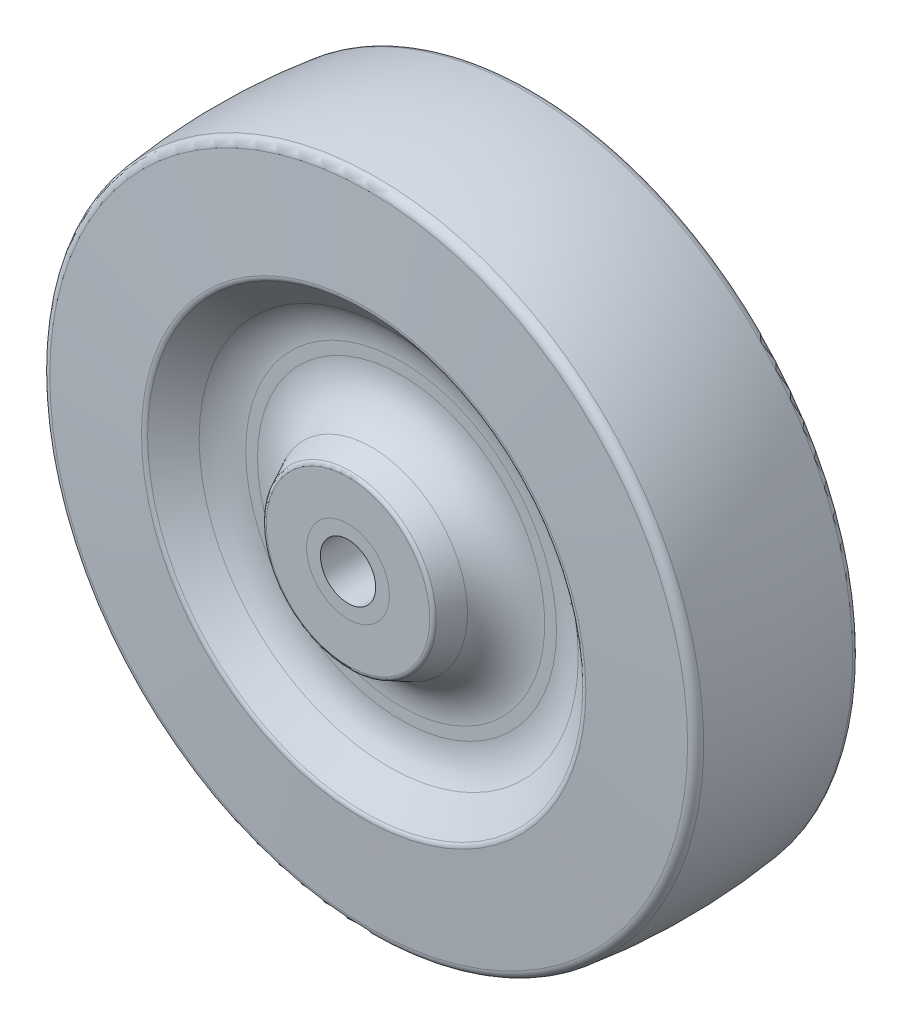
ISO-10303-21;
HEADER;
FILE_DESCRIPTION(('STEP AP214'),'2;1');
FILE_NAME('part.step','',(''),(''),'','','');
FILE_SCHEMA(('AUTOMOTIVE_DESIGN { 1 0 10303 214 1 1 1 1 }'));
ENDSEC;
DATA;
#1=APPLICATION_CONTEXT('core data for automotive mechanical design processes');
#2=APPLICATION_PROTOCOL_DEFINITION('international standard','automotive_design',2000,#1);
#3=PRODUCT_CONTEXT('',#1,'mechanical');
#4=PRODUCT('Part','Part','',(#3));
#5=PRODUCT_RELATED_PRODUCT_CATEGORY('part','',(#4));
#6=PRODUCT_DEFINITION_FORMATION('','',#4);
#7=PRODUCT_DEFINITION_CONTEXT('part definition',#1,'design');
#8=PRODUCT_DEFINITION('design','',#6,#7);
#9=PRODUCT_DEFINITION_SHAPE('','',#8);
#10=(LENGTH_UNIT() NAMED_UNIT(*) SI_UNIT(.MILLI.,.METRE.));
#11=(NAMED_UNIT(*) PLANE_ANGLE_UNIT() SI_UNIT($,.RADIAN.));
#12=(NAMED_UNIT(*) SI_UNIT($,.STERADIAN.) SOLID_ANGLE_UNIT());
#13=UNCERTAINTY_MEASURE_WITH_UNIT(LENGTH_MEASURE(1.E-05),#10,'distance_accuracy_value','');
#14=(GEOMETRIC_REPRESENTATION_CONTEXT(3) GLOBAL_UNCERTAINTY_ASSIGNED_CONTEXT((#13)) GLOBAL_UNIT_ASSIGNED_CONTEXT((#10,
#11,#12)) REPRESENTATION_CONTEXT('',''));
#15=CARTESIAN_POINT('',(0.,0.,0.));
#16=DIRECTION('',(0.,0.,1.));
#17=DIRECTION('',(1.,0.,0.));
#18=AXIS2_PLACEMENT_3D('',#15,#16,#17);
#19=CARTESIAN_POINT('',(0.,0.,11.8237));
#20=DIRECTION('',(0.,0.,-1.));
#21=DIRECTION('',(-1.,0.,0.));
#22=AXIS2_PLACEMENT_3D('',#19,#20,#21);
#23=PLANE('',#22);
#24=CARTESIAN_POINT('',(0.,0.,11.8237));
#25=DIRECTION('',(0.,0.,1.));
#26=DIRECTION('',(1.,0.,0.));
#27=AXIS2_PLACEMENT_3D('',#24,#25,#26);
#28=CIRCLE('',#27,3.175);
#29=CARTESIAN_POINT('',(3.175,0.,11.8237));
#30=VERTEX_POINT('',#29);
#31=EDGE_CURVE('E54',#30,#30,#28,.T.);
#32=ORIENTED_EDGE('',*,*,#31,.F.);
#33=EDGE_LOOP('',(#32));
#34=FACE_BOUND('',#33,.T.);
#35=CARTESIAN_POINT('',(0.,0.,11.8237));
#36=DIRECTION('',(0.,0.,1.));
#37=DIRECTION('',(1.,0.,0.));
#38=AXIS2_PLACEMENT_3D('',#35,#36,#37);
#39=CIRCLE('',#38,4.7498);
#40=CARTESIAN_POINT('',(4.7498,0.,11.8237));
#41=VERTEX_POINT('',#40);
#42=EDGE_CURVE('E46',#41,#41,#39,.T.);
#43=ORIENTED_EDGE('',*,*,#42,.T.);
#44=EDGE_LOOP('',(#43));
#45=FACE_BOUND('',#44,.T.);
#46=ADVANCED_FACE('F40',(#34,#45),#23,.F.);
#47=CARTESIAN_POINT('',(0.,0.,-11.8237));
#48=DIRECTION('',(0.,0.,1.));
#49=DIRECTION('',(1.,0.,0.));
#50=AXIS2_PLACEMENT_3D('',#47,#48,#49);
#51=PLANE('',#50);
#52=CARTESIAN_POINT('',(0.,0.,-11.8237));
#53=DIRECTION('',(0.,0.,1.));
#54=DIRECTION('',(1.,0.,0.));
#55=AXIS2_PLACEMENT_3D('',#52,#53,#54);
#56=CIRCLE('',#55,3.175);
#57=CARTESIAN_POINT('',(3.175,0.,-11.8237));
#58=VERTEX_POINT('',#57);
#59=EDGE_CURVE('E50',#58,#58,#56,.T.);
#60=ORIENTED_EDGE('',*,*,#59,.T.);
#61=EDGE_LOOP('',(#60));
#62=FACE_BOUND('',#61,.T.);
#63=CARTESIAN_POINT('',(0.,0.,-11.8237));
#64=DIRECTION('',(0.,0.,1.));
#65=DIRECTION('',(1.,0.,0.));
#66=AXIS2_PLACEMENT_3D('',#63,#64,#65);
#67=CIRCLE('',#66,4.7498);
#68=CARTESIAN_POINT('',(4.7498,0.,-11.8237));
#69=VERTEX_POINT('',#68);
#70=EDGE_CURVE('E11',#69,#69,#67,.T.);
#71=ORIENTED_EDGE('',*,*,#70,.F.);
#72=EDGE_LOOP('',(#71));
#73=FACE_BOUND('',#72,.T.);
#74=ADVANCED_FACE('F63',(#62,#73),#51,.F.);
#75=CARTESIAN_POINT('',(0.,0.,11.8237));
#76=DIRECTION('',(0.,0.,1.));
#77=DIRECTION('',(1.,0.,0.));
#78=AXIS2_PLACEMENT_3D('',#75,#76,#77);
#79=CYLINDRICAL_SURFACE('',#78,4.7498);
#80=ORIENTED_EDGE('',*,*,#42,.F.);
#81=EDGE_LOOP('',(#80));
#82=FACE_BOUND('',#81,.T.);
#83=ORIENTED_EDGE('',*,*,#70,.T.);
#84=EDGE_LOOP('',(#83));
#85=FACE_BOUND('',#84,.T.);
#86=ADVANCED_FACE('F67',(#82,#85),#79,.T.);
#87=CARTESIAN_POINT('',(0.,0.,-11.8237));
#88=DIRECTION('',(0.,0.,1.));
#89=DIRECTION('',(1.,0.,0.));
#90=AXIS2_PLACEMENT_3D('',#87,#88,#89);
#91=CYLINDRICAL_SURFACE('',#90,3.175);
#92=ORIENTED_EDGE('',*,*,#59,.F.);
#93=EDGE_LOOP('',(#92));
#94=FACE_BOUND('',#93,.T.);
#95=ORIENTED_EDGE('',*,*,#31,.T.);
#96=EDGE_LOOP('',(#95));
#97=FACE_BOUND('',#96,.T.);
#98=ADVANCED_FACE('F60',(#94,#97),#91,.F.);
#99=CLOSED_SHELL('',(#46,#74,#86,#98));
#100=MANIFOLD_SOLID_BREP('B2',#99);
#101=CARTESIAN_POINT('',(0.,9.7028,11.8237));
#102=DIRECTION('',(0.,0.,-1.));
#103=DIRECTION('',(-1.,0.,0.));
#104=AXIS2_PLACEMENT_3D('',#101,#102,#103);
#105=PLANE('',#104);
#106=CARTESIAN_POINT('',(0.,0.,11.8237));
#107=DIRECTION('',(0.,0.,-1.));
#108=DIRECTION('',(-1.,0.,0.));
#109=AXIS2_PLACEMENT_3D('',#106,#107,#108);
#110=CIRCLE('',#109,9.38648594117093);
#111=CARTESIAN_POINT('',(-9.38648594117093,0.,11.8237));
#112=VERTEX_POINT('',#111);
#113=EDGE_CURVE('E116',#112,#112,#110,.F.);
#114=ORIENTED_EDGE('',*,*,#113,.T.);
#115=EDGE_LOOP('',(#114));
#116=FACE_BOUND('',#115,.T.);
#117=CARTESIAN_POINT('',(0.,0.,11.8237));
#118=DIRECTION('',(0.,0.,1.));
#119=DIRECTION('',(1.,0.,0.));
#120=AXIS2_PLACEMENT_3D('',#117,#118,#119);
#121=CIRCLE('',#120,4.7498);
#122=CARTESIAN_POINT('',(4.7498,0.,11.8237));
#123=VERTEX_POINT('',#122);
#124=EDGE_CURVE('E169',#123,#123,#121,.T.);
#125=ORIENTED_EDGE('',*,*,#124,.F.);
#126=EDGE_LOOP('',(#125));
#127=FACE_BOUND('',#126,.T.);
#128=ADVANCED_FACE('F101',(#116,#127),#105,.F.);
#129=CARTESIAN_POINT('',(0.,0.,5.7277));
#130=DIRECTION('',(0.,0.,-1.));
#131=DIRECTION('',(-1.,0.,0.));
#132=AXIS2_PLACEMENT_3D('',#129,#130,#131);
#133=CONICAL_SURFACE('',#132,12.7,0.456958745547133);
#134=CARTESIAN_POINT('',(0.,0.,11.539840234691));
#135=DIRECTION('',(0.,0.,1.));
#136=DIRECTION('',(1.,0.,0.));
#137=AXIS2_PLACEMENT_3D('',#134,#135,#136);
#138=CIRCLE('',#137,9.84236438461026);
#139=CARTESIAN_POINT('',(9.84236438461026,0.,11.539840234691));
#140=VERTEX_POINT('',#139);
#141=EDGE_CURVE('E112',#140,#140,#138,.F.);
#142=ORIENTED_EDGE('',*,*,#141,.T.);
#143=EDGE_LOOP('',(#142));
#144=FACE_BOUND('',#143,.T.);
#145=CARTESIAN_POINT('',(0.,0.,9.13401718370798));
#146=DIRECTION('',(0.,0.,-1.));
#147=DIRECTION('',(-1.,0.,0.));
#148=AXIS2_PLACEMENT_3D('',#145,#146,#147);
#149=CIRCLE('',#148,11.0252273846769);
#150=CARTESIAN_POINT('',(-11.0252273846769,0.,9.13401718370798));
#151=VERTEX_POINT('',#150);
#152=EDGE_CURVE('E154',#151,#151,#149,.F.);
#153=ORIENTED_EDGE('',*,*,#152,.T.);
#154=EDGE_LOOP('',(#153));
#155=FACE_BOUND('',#154,.T.);
#156=ADVANCED_FACE('F193',(#144,#155),#133,.T.);
#157=CARTESIAN_POINT('',(0.,20.066,5.7277));
#158=DIRECTION('',(0.,0.,-1.));
#159=DIRECTION('',(-1.,0.,0.));
#160=AXIS2_PLACEMENT_3D('',#157,#158,#159);
#161=PLANE('',#160);
#162=CARTESIAN_POINT('',(0.,0.,5.7277));
#163=DIRECTION('',(0.,0.,-1.));
#164=DIRECTION('',(-1.,0.,0.));
#165=AXIS2_PLACEMENT_3D('',#162,#163,#164);
#166=CIRCLE('',#165,16.4957687059488);
#167=CARTESIAN_POINT('',(-16.4957687059488,0.,5.7277));
#168=VERTEX_POINT('',#167);
#169=EDGE_CURVE('E148',#168,#168,#166,.T.);
#170=ORIENTED_EDGE('',*,*,#169,.T.);
#171=EDGE_LOOP('',(#170));
#172=FACE_BOUND('',#171,.T.);
#173=CARTESIAN_POINT('',(0.,0.,5.7277));
#174=DIRECTION('',(0.,0.,-1.));
#175=DIRECTION('',(-1.,0.,0.));
#176=AXIS2_PLACEMENT_3D('',#173,#174,#175);
#177=CIRCLE('',#176,17.8472374519132);
#178=CARTESIAN_POINT('',(-17.8472374519132,0.,5.7277));
#179=VERTEX_POINT('',#178);
#180=EDGE_CURVE('E151',#179,#179,#177,.F.);
#181=ORIENTED_EDGE('',*,*,#180,.T.);
#182=EDGE_LOOP('',(#181));
#183=FACE_BOUND('',#182,.T.);
#184=ADVANCED_FACE('F199',(#172,#183),#161,.F.);
#185=CARTESIAN_POINT('',(0.,0.,10.0457));
#186=DIRECTION('',(0.,0.,1.));
#187=DIRECTION('',(1.,0.,0.));
#188=AXIS2_PLACEMENT_3D('',#185,#186,#187);
#189=CONICAL_SURFACE('',#188,25.2119920128217,0.872664625997159);
#190=CARTESIAN_POINT('',(0.,0.,9.85276101093513));
#191=DIRECTION('',(0.,0.,-1.));
#192=DIRECTION('',(-1.,0.,0.));
#193=AXIS2_PLACEMENT_3D('',#190,#191,#192);
#194=CIRCLE('',#193,24.9820562794522);
#195=CARTESIAN_POINT('',(-24.9820562794522,0.,9.85276101093513));
#196=VERTEX_POINT('',#195);
#197=EDGE_CURVE('E130',#196,#196,#194,.F.);
#198=ORIENTED_EDGE('',*,*,#197,.T.);
#199=EDGE_LOOP('',(#198));
#200=FACE_BOUND('',#199,.T.);
#201=CARTESIAN_POINT('',(0.,0.,7.15389307474673));
#202=DIRECTION('',(0.,0.,1.));
#203=DIRECTION('',(1.,0.,0.));
#204=AXIS2_PLACEMENT_3D('',#201,#202,#203);
#205=CIRCLE('',#204,21.7656707205624);
#206=CARTESIAN_POINT('',(21.7656707205624,0.,7.15389307474673));
#207=VERTEX_POINT('',#206);
#208=EDGE_CURVE('E145',#207,#207,#205,.F.);
#209=ORIENTED_EDGE('',*,*,#208,.T.);
#210=EDGE_LOOP('',(#209));
#211=FACE_BOUND('',#210,.T.);
#212=ADVANCED_FACE('F327',(#200,#211),#189,.F.);
#213=CARTESIAN_POINT('',(0.,0.,9.40359297940193));
#214=DIRECTION('',(0.,0.,-1.));
#215=DIRECTION('',(-1.,0.,0.));
#216=AXIS2_PLACEMENT_3D('',#213,#214,#215);
#217=CONICAL_SURFACE('',#216,37.4641238410033,1.51843644923507);
#218=CARTESIAN_POINT('',(0.,0.,10.0299908507615));
#219=DIRECTION('',(0.,0.,1.));
#220=DIRECTION('',(1.,0.,0.));
#221=AXIS2_PLACEMENT_3D('',#218,#219,#220);
#222=CIRCLE('',#221,25.5117404366905);
#223=CARTESIAN_POINT('',(25.5117404366905,0.,10.0299908507615));
#224=VERTEX_POINT('',#223);
#225=EDGE_CURVE('E127',#224,#224,#222,.F.);
#226=ORIENTED_EDGE('',*,*,#225,.T.);
#227=EDGE_LOOP('',(#226));
#228=FACE_BOUND('',#227,.T.);
#229=CARTESIAN_POINT('',(0.,0.,9.44790441551916));
#230=DIRECTION('',(0.,0.,1.));
#231=DIRECTION('',(1.,0.,0.));
#232=AXIS2_PLACEMENT_3D('',#229,#230,#231);
#233=CIRCLE('',#232,36.6186112716209);
#234=CARTESIAN_POINT('',(36.6186112716209,0.,9.44790441551916));
#235=VERTEX_POINT('',#234);
#236=EDGE_CURVE('E166',#235,#235,#233,.T.);
#237=ORIENTED_EDGE('',*,*,#236,.T.);
#238=EDGE_LOOP('',(#237));
#239=FACE_BOUND('',#238,.T.);
#240=ADVANCED_FACE('F322',(#228,#239),#217,.T.);
#241=CARTESIAN_POINT('',(0.,0.,0.));
#242=DIRECTION('',(0.,0.,1.));
#243=DIRECTION('',(1.,0.,0.));
#244=AXIS2_PLACEMENT_3D('',#241,#242,#243);
#245=DEGENERATE_TOROIDAL_SURFACE('',#244,31.75,69.85,.F.);
#246=CARTESIAN_POINT('',(0.,0.,8.55777351386473));
#247=DIRECTION('',(0.,0.,-1.));
#248=DIRECTION('',(-1.,0.,0.));
#249=AXIS2_PLACEMENT_3D('',#246,#247,#248);
#250=CIRCLE('',#249,37.5737838875331);
#251=CARTESIAN_POINT('',(-37.5737838875331,0.,8.55777351386473));
#252=VERTEX_POINT('',#251);
#253=EDGE_CURVE('E160',#252,#252,#250,.T.);
#254=ORIENTED_EDGE('',*,*,#253,.T.);
#255=EDGE_LOOP('',(#254));
#256=FACE_BOUND('',#255,.T.);
#257=CARTESIAN_POINT('',(0.,0.,-8.55777351386473));
#258=DIRECTION('',(0.,0.,1.));
#259=DIRECTION('',(1.,0.,0.));
#260=AXIS2_PLACEMENT_3D('',#257,#258,#259);
#261=CIRCLE('',#260,37.5737838875331);
#262=CARTESIAN_POINT('',(37.5737838875331,0.,-8.55777351386473));
#263=VERTEX_POINT('',#262);
#264=EDGE_CURVE('E163',#263,#263,#261,.T.);
#265=ORIENTED_EDGE('',*,*,#264,.T.);
#266=EDGE_LOOP('',(#265));
#267=FACE_BOUND('',#266,.T.);
#268=ADVANCED_FACE('F314',(#256,#267),#245,.F.);
#269=CARTESIAN_POINT('',(0.,0.,-10.0457));
#270=DIRECTION('',(0.,0.,1.));
#271=DIRECTION('',(1.,0.,0.));
#272=AXIS2_PLACEMENT_3D('',#269,#270,#271);
#273=CONICAL_SURFACE('',#272,25.2119920128217,1.51843644923507);
#274=CARTESIAN_POINT('',(0.,0.,-10.0299908507614));
#275=DIRECTION('',(0.,0.,-1.));
#276=DIRECTION('',(-1.,0.,0.));
#277=AXIS2_PLACEMENT_3D('',#274,#275,#276);
#278=CIRCLE('',#277,25.5117404366905);
#279=CARTESIAN_POINT('',(-25.5117404366905,0.,-10.0299908507614));
#280=VERTEX_POINT('',#279);
#281=EDGE_CURVE('E124',#280,#280,#278,.F.);
#282=ORIENTED_EDGE('',*,*,#281,.T.);
#283=EDGE_LOOP('',(#282));
#284=FACE_BOUND('',#283,.T.);
#285=CARTESIAN_POINT('',(0.,0.,-9.44790441551917));
#286=DIRECTION('',(0.,0.,-1.));
#287=DIRECTION('',(-1.,0.,0.));
#288=AXIS2_PLACEMENT_3D('',#285,#286,#287);
#289=CIRCLE('',#288,36.6186112716209);
#290=CARTESIAN_POINT('',(-36.6186112716209,0.,-9.44790441551917));
#291=VERTEX_POINT('',#290);
#292=EDGE_CURVE('E157',#291,#291,#289,.T.);
#293=ORIENTED_EDGE('',*,*,#292,.T.);
#294=EDGE_LOOP('',(#293));
#295=FACE_BOUND('',#294,.T.);
#296=ADVANCED_FACE('F304',(#284,#295),#273,.T.);
#297=CARTESIAN_POINT('',(0.,0.,-5.7277));
#298=DIRECTION('',(0.,0.,-1.));
#299=DIRECTION('',(-1.,0.,0.));
#300=AXIS2_PLACEMENT_3D('',#297,#298,#299);
#301=CONICAL_SURFACE('',#300,20.066,0.87266462599716);
#302=CARTESIAN_POINT('',(0.,0.,-9.85276101093512));
#303=DIRECTION('',(0.,0.,1.));
#304=DIRECTION('',(1.,0.,0.));
#305=AXIS2_PLACEMENT_3D('',#302,#303,#304);
#306=CIRCLE('',#305,24.9820562794522);
#307=CARTESIAN_POINT('',(24.9820562794522,0.,-9.85276101093512));
#308=VERTEX_POINT('',#307);
#309=EDGE_CURVE('E121',#308,#308,#306,.F.);
#310=ORIENTED_EDGE('',*,*,#309,.T.);
#311=EDGE_LOOP('',(#310));
#312=FACE_BOUND('',#311,.T.);
#313=CARTESIAN_POINT('',(0.,0.,-7.15389307474672));
#314=DIRECTION('',(0.,0.,-1.));
#315=DIRECTION('',(-1.,0.,0.));
#316=AXIS2_PLACEMENT_3D('',#313,#314,#315);
#317=CIRCLE('',#316,21.7656707205624);
#318=CARTESIAN_POINT('',(-21.7656707205624,0.,-7.15389307474672));
#319=VERTEX_POINT('',#318);
#320=EDGE_CURVE('E133',#319,#319,#317,.F.);
#321=ORIENTED_EDGE('',*,*,#320,.T.);
#322=EDGE_LOOP('',(#321));
#323=FACE_BOUND('',#322,.T.);
#324=ADVANCED_FACE('F299',(#312,#323),#301,.F.);
#325=CARTESIAN_POINT('',(0.,20.066,-5.7277));
#326=DIRECTION('',(0.,0.,1.));
#327=DIRECTION('',(1.,0.,0.));
#328=AXIS2_PLACEMENT_3D('',#325,#326,#327);
#329=PLANE('',#328);
#330=CARTESIAN_POINT('',(0.,0.,-5.7277));
#331=DIRECTION('',(0.,0.,1.));
#332=DIRECTION('',(1.,0.,0.));
#333=AXIS2_PLACEMENT_3D('',#330,#331,#332);
#334=CIRCLE('',#333,16.4957687059488);
#335=CARTESIAN_POINT('',(16.4957687059488,0.,-5.7277));
#336=VERTEX_POINT('',#335);
#337=EDGE_CURVE('E139',#336,#336,#334,.T.);
#338=ORIENTED_EDGE('',*,*,#337,.T.);
#339=EDGE_LOOP('',(#338));
#340=FACE_BOUND('',#339,.T.);
#341=CARTESIAN_POINT('',(0.,0.,-5.7277));
#342=DIRECTION('',(0.,0.,1.));
#343=DIRECTION('',(1.,0.,0.));
#344=AXIS2_PLACEMENT_3D('',#341,#342,#343);
#345=CIRCLE('',#344,17.8472374519132);
#346=CARTESIAN_POINT('',(17.8472374519132,0.,-5.7277));
#347=VERTEX_POINT('',#346);
#348=EDGE_CURVE('E142',#347,#347,#345,.F.);
#349=ORIENTED_EDGE('',*,*,#348,.T.);
#350=EDGE_LOOP('',(#349));
#351=FACE_BOUND('',#350,.T.);
#352=ADVANCED_FACE('F268',(#340,#351),#329,.F.);
#353=CARTESIAN_POINT('',(0.,0.,-11.8237));
#354=DIRECTION('',(0.,0.,1.));
#355=DIRECTION('',(1.,0.,0.));
#356=AXIS2_PLACEMENT_3D('',#353,#354,#355);
#357=CONICAL_SURFACE('',#356,9.7028,0.456958745547133);
#358=CARTESIAN_POINT('',(0.,0.,-11.539840234691));
#359=DIRECTION('',(0.,0.,-1.));
#360=DIRECTION('',(-1.,0.,0.));
#361=AXIS2_PLACEMENT_3D('',#358,#359,#360);
#362=CIRCLE('',#361,9.84236438461026);
#363=CARTESIAN_POINT('',(-9.84236438461026,0.,-11.539840234691));
#364=VERTEX_POINT('',#363);
#365=EDGE_CURVE('E108',#364,#364,#362,.F.);
#366=ORIENTED_EDGE('',*,*,#365,.T.);
#367=EDGE_LOOP('',(#366));
#368=FACE_BOUND('',#367,.T.);
#369=CARTESIAN_POINT('',(0.,0.,-9.13401718370798));
#370=DIRECTION('',(0.,0.,1.));
#371=DIRECTION('',(1.,0.,0.));
#372=AXIS2_PLACEMENT_3D('',#369,#370,#371);
#373=CIRCLE('',#372,11.0252273846769);
#374=CARTESIAN_POINT('',(11.0252273846769,0.,-9.13401718370798));
#375=VERTEX_POINT('',#374);
#376=EDGE_CURVE('E136',#375,#375,#373,.F.);
#377=ORIENTED_EDGE('',*,*,#376,.T.);
#378=EDGE_LOOP('',(#377));
#379=FACE_BOUND('',#378,.T.);
#380=ADVANCED_FACE('F190',(#368,#379),#357,.T.);
#381=CARTESIAN_POINT('',(0.,9.7028,-11.8237));
#382=DIRECTION('',(0.,0.,1.));
#383=DIRECTION('',(1.,0.,0.));
#384=AXIS2_PLACEMENT_3D('',#381,#382,#383);
#385=PLANE('',#384);
#386=CARTESIAN_POINT('',(0.,0.,-11.8237));
#387=DIRECTION('',(0.,0.,1.));
#388=DIRECTION('',(1.,0.,0.));
#389=AXIS2_PLACEMENT_3D('',#386,#387,#388);
#390=CIRCLE('',#389,9.38648594117093);
#391=CARTESIAN_POINT('',(9.38648594117093,0.,-11.8237));
#392=VERTEX_POINT('',#391);
#393=EDGE_CURVE('E39',#392,#392,#390,.F.);
#394=ORIENTED_EDGE('',*,*,#393,.T.);
#395=EDGE_LOOP('',(#394));
#396=FACE_BOUND('',#395,.T.);
#397=CARTESIAN_POINT('',(0.,0.,-11.8237));
#398=DIRECTION('',(0.,0.,1.));
#399=DIRECTION('',(1.,0.,0.));
#400=AXIS2_PLACEMENT_3D('',#397,#398,#399);
#401=CIRCLE('',#400,4.7498);
#402=CARTESIAN_POINT('',(4.7498,0.,-11.8237));
#403=VERTEX_POINT('',#402);
#404=EDGE_CURVE('E172',#403,#403,#401,.T.);
#405=ORIENTED_EDGE('',*,*,#404,.T.);
#406=EDGE_LOOP('',(#405));
#407=FACE_BOUND('',#406,.T.);
#408=ADVANCED_FACE('F176',(#396,#407),#385,.F.);
#409=CARTESIAN_POINT('',(0.,0.,11.8237));
#410=DIRECTION('',(0.,0.,1.));
#411=DIRECTION('',(1.,0.,0.));
#412=AXIS2_PLACEMENT_3D('',#409,#410,#411);
#413=CYLINDRICAL_SURFACE('',#412,4.7498);
#414=ORIENTED_EDGE('',*,*,#124,.T.);
#415=EDGE_LOOP('',(#414));
#416=FACE_BOUND('',#415,.T.);
#417=ORIENTED_EDGE('',*,*,#404,.F.);
#418=EDGE_LOOP('',(#417));
#419=FACE_BOUND('',#418,.T.);
#420=ADVANCED_FACE('F178',(#416,#419),#413,.F.);
#421=CARTESIAN_POINT('',(0.,0.,8.43329680820851));
#422=DIRECTION('',(0.,0.,-1.));
#423=DIRECTION('',(-1.,0.,0.));
#424=AXIS2_PLACEMENT_3D('',#421,#422,#423);
#425=TOROIDAL_SURFACE('',#424,36.5654379400781,1.016);
#426=ORIENTED_EDGE('',*,*,#253,.F.);
#427=EDGE_LOOP('',(#426));
#428=FACE_BOUND('',#427,.T.);
#429=ORIENTED_EDGE('',*,*,#236,.F.);
#430=EDGE_LOOP('',(#429));
#431=FACE_BOUND('',#430,.T.);
#432=ADVANCED_FACE('F180',(#428,#431),#425,.T.);
#433=CARTESIAN_POINT('',(0.,0.,-8.43329680820852));
#434=DIRECTION('',(0.,0.,-1.));
#435=DIRECTION('',(-1.,0.,0.));
#436=AXIS2_PLACEMENT_3D('',#433,#434,#435);
#437=TOROIDAL_SURFACE('',#436,36.5654379400781,1.016);
#438=ORIENTED_EDGE('',*,*,#292,.F.);
#439=EDGE_LOOP('',(#438));
#440=FACE_BOUND('',#439,.T.);
#441=ORIENTED_EDGE('',*,*,#264,.F.);
#442=EDGE_LOOP('',(#441));
#443=FACE_BOUND('',#442,.T.);
#444=ADVANCED_FACE('F187',(#440,#443),#437,.T.);
#445=CARTESIAN_POINT('',(0.,0.,11.8237));
#446=DIRECTION('',(0.,0.,-1.));
#447=DIRECTION('',(-1.,0.,0.));
#448=AXIS2_PLACEMENT_3D('',#445,#446,#447);
#449=TOROIDAL_SURFACE('',#448,16.4957687059488,6.096);
#450=ORIENTED_EDGE('',*,*,#169,.F.);
#451=EDGE_LOOP('',(#450));
#452=FACE_BOUND('',#451,.T.);
#453=ORIENTED_EDGE('',*,*,#152,.F.);
#454=EDGE_LOOP('',(#453));
#455=FACE_BOUND('',#454,.T.);
#456=ADVANCED_FACE('F207',(#452,#455),#449,.F.);
#457=CARTESIAN_POINT('',(0.,0.,11.8237));
#458=DIRECTION('',(0.,0.,-1.));
#459=DIRECTION('',(-1.,0.,0.));
#460=AXIS2_PLACEMENT_3D('',#457,#458,#459);
#461=TOROIDAL_SURFACE('',#460,17.8472374519132,6.096);
#462=ORIENTED_EDGE('',*,*,#208,.F.);
#463=EDGE_LOOP('',(#462));
#464=FACE_BOUND('',#463,.T.);
#465=ORIENTED_EDGE('',*,*,#180,.F.);
#466=EDGE_LOOP('',(#465));
#467=FACE_BOUND('',#466,.T.);
#468=ADVANCED_FACE('F211',(#464,#467),#461,.F.);
#469=CARTESIAN_POINT('',(0.,0.,-11.8237));
#470=DIRECTION('',(0.,0.,1.));
#471=DIRECTION('',(1.,0.,0.));
#472=AXIS2_PLACEMENT_3D('',#469,#470,#471);
#473=TOROIDAL_SURFACE('',#472,16.4957687059488,6.096);
#474=ORIENTED_EDGE('',*,*,#376,.F.);
#475=EDGE_LOOP('',(#474));
#476=FACE_BOUND('',#475,.T.);
#477=ORIENTED_EDGE('',*,*,#337,.F.);
#478=EDGE_LOOP('',(#477));
#479=FACE_BOUND('',#478,.T.);
#480=ADVANCED_FACE('F215',(#476,#479),#473,.F.);
#481=CARTESIAN_POINT('',(0.,0.,-11.8237));
#482=DIRECTION('',(0.,0.,1.));
#483=DIRECTION('',(1.,0.,0.));
#484=AXIS2_PLACEMENT_3D('',#481,#482,#483);
#485=TOROIDAL_SURFACE('',#484,17.8472374519132,6.096);
#486=ORIENTED_EDGE('',*,*,#348,.F.);
#487=EDGE_LOOP('',(#486));
#488=FACE_BOUND('',#487,.T.);
#489=ORIENTED_EDGE('',*,*,#320,.F.);
#490=EDGE_LOOP('',(#489));
#491=FACE_BOUND('',#490,.T.);
#492=ADVANCED_FACE('F219',(#488,#491),#485,.F.);
#493=CARTESIAN_POINT('',(0.,0.,9.26903514527847));
#494=DIRECTION('',(0.,0.,-1.));
#495=DIRECTION('',(-1.,0.,0.));
#496=AXIS2_PLACEMENT_3D('',#493,#494,#495);
#497=TOROIDAL_SURFACE('',#496,25.4718604380333,0.762);
#498=ORIENTED_EDGE('',*,*,#225,.F.);
#499=EDGE_LOOP('',(#498));
#500=FACE_BOUND('',#499,.T.);
#501=ORIENTED_EDGE('',*,*,#197,.F.);
#502=EDGE_LOOP('',(#501));
#503=FACE_BOUND('',#502,.T.);
#504=ADVANCED_FACE('F223',(#500,#503),#497,.T.);
#505=CARTESIAN_POINT('',(0.,0.,-9.26903514527846));
#506=DIRECTION('',(0.,0.,-1.));
#507=DIRECTION('',(-1.,0.,0.));
#508=AXIS2_PLACEMENT_3D('',#505,#506,#507);
#509=TOROIDAL_SURFACE('',#508,25.4718604380333,0.762);
#510=ORIENTED_EDGE('',*,*,#309,.F.);
#511=EDGE_LOOP('',(#510));
#512=FACE_BOUND('',#511,.T.);
#513=ORIENTED_EDGE('',*,*,#281,.F.);
#514=EDGE_LOOP('',(#513));
#515=FACE_BOUND('',#514,.T.);
#516=ADVANCED_FACE('F227',(#512,#515),#509,.T.);
#517=CARTESIAN_POINT('',(0.,0.,11.3157));
#518=DIRECTION('',(0.,0.,-1.));
#519=DIRECTION('',(-1.,0.,0.));
#520=AXIS2_PLACEMENT_3D('',#517,#518,#519);
#521=TOROIDAL_SURFACE('',#520,9.38648594117093,0.508);
#522=ORIENTED_EDGE('',*,*,#141,.F.);
#523=EDGE_LOOP('',(#522));
#524=FACE_BOUND('',#523,.T.);
#525=ORIENTED_EDGE('',*,*,#113,.F.);
#526=EDGE_LOOP('',(#525));
#527=FACE_BOUND('',#526,.T.);
#528=ADVANCED_FACE('F230',(#524,#527),#521,.T.);
#529=CARTESIAN_POINT('',(0.,0.,-11.3157));
#530=DIRECTION('',(0.,0.,1.));
#531=DIRECTION('',(1.,0.,0.));
#532=AXIS2_PLACEMENT_3D('',#529,#530,#531);
#533=TOROIDAL_SURFACE('',#532,9.38648594117093,0.508);
#534=ORIENTED_EDGE('',*,*,#393,.F.);
#535=EDGE_LOOP('',(#534));
#536=FACE_BOUND('',#535,.T.);
#537=ORIENTED_EDGE('',*,*,#365,.F.);
#538=EDGE_LOOP('',(#537));
#539=FACE_BOUND('',#538,.T.);
#540=ADVANCED_FACE('F103',(#536,#539),#533,.T.);
#541=CLOSED_SHELL('',(#128,#156,#184,#212,#240,#268,#296,#324,#352,#380,#408,#420,#432,#444,
#456,#468,#480,#492,#504,#516,#528,#540));
#542=MANIFOLD_SOLID_BREP('B6',#541);
#543=ADVANCED_BREP_SHAPE_REPRESENTATION('',(#18,#100,#542),#14);
#544=SHAPE_DEFINITION_REPRESENTATION(#9,#543);
ENDSEC;
END-ISO-10303-21;
